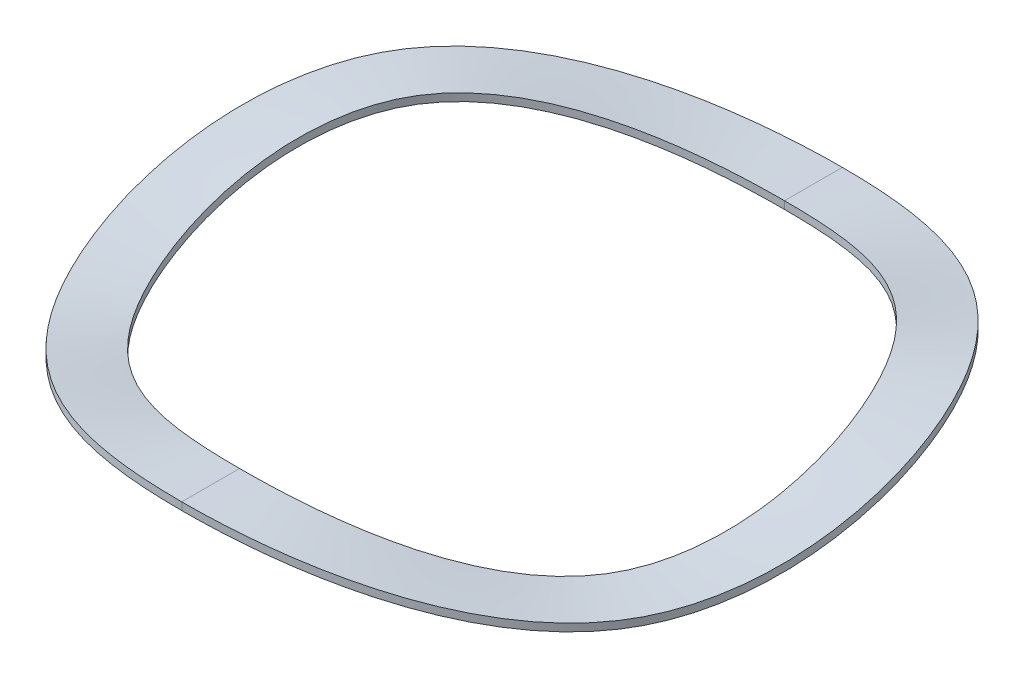
ISO-10303-21;
HEADER;
FILE_DESCRIPTION(('STEP AP214'),'2;1');
FILE_NAME('part.step','',(''),(''),'','','');
FILE_SCHEMA(('AUTOMOTIVE_DESIGN { 1 0 10303 214 1 1 1 1 }'));
ENDSEC;
DATA;
#1=APPLICATION_CONTEXT('core data for automotive mechanical design processes');
#2=APPLICATION_PROTOCOL_DEFINITION('international standard','automotive_design',2000,#1);
#3=PRODUCT_CONTEXT('',#1,'mechanical');
#4=PRODUCT('Part','Part','',(#3));
#5=PRODUCT_RELATED_PRODUCT_CATEGORY('part','',(#4));
#6=PRODUCT_DEFINITION_FORMATION('','',#4);
#7=PRODUCT_DEFINITION_CONTEXT('part definition',#1,'design');
#8=PRODUCT_DEFINITION('design','',#6,#7);
#9=PRODUCT_DEFINITION_SHAPE('','',#8);
#10=(LENGTH_UNIT() NAMED_UNIT(*) SI_UNIT(.MILLI.,.METRE.));
#11=(NAMED_UNIT(*) PLANE_ANGLE_UNIT() SI_UNIT($,.RADIAN.));
#12=(NAMED_UNIT(*) SI_UNIT($,.STERADIAN.) SOLID_ANGLE_UNIT());
#13=UNCERTAINTY_MEASURE_WITH_UNIT(LENGTH_MEASURE(1.E-05),#10,'distance_accuracy_value','');
#14=(GEOMETRIC_REPRESENTATION_CONTEXT(3) GLOBAL_UNCERTAINTY_ASSIGNED_CONTEXT((#13)) GLOBAL_UNIT_ASSIGNED_CONTEXT((#10,
#11,#12)) REPRESENTATION_CONTEXT('',''));
#15=CARTESIAN_POINT('',(0.,0.,0.));
#16=DIRECTION('',(0.,0.,1.));
#17=DIRECTION('',(1.,0.,0.));
#18=AXIS2_PLACEMENT_3D('',#15,#16,#17);
#19=CARTESIAN_POINT('',(0.,0.,-10.4775));
#20=CARTESIAN_POINT('',(3.62951246726,0.,-10.4775));
#21=CARTESIAN_POINT('',(10.8885374018,3.1242,-6.2865));
#22=CARTESIAN_POINT('',(10.8885374018,-1.5621,6.2865));
#23=CARTESIAN_POINT('',(3.62951246726,1.5621,10.4775));
#24=CARTESIAN_POINT('',(0.,1.5621,10.4775));
#25=CARTESIAN_POINT('',(0.,0.,-11.2183333333));
#26=CARTESIAN_POINT('',(3.88614466192,0.,-11.2183333333));
#27=CARTESIAN_POINT('',(11.6584339857,3.1242,-6.731));
#28=CARTESIAN_POINT('',(11.6584339857,-1.5621,6.731));
#29=CARTESIAN_POINT('',(3.88614466192,1.5621,11.2183333333));
#30=CARTESIAN_POINT('',(0.,1.5621,11.2183333333));
#31=CARTESIAN_POINT('',(0.,0.,-11.9591666667));
#32=CARTESIAN_POINT('',(4.14277685657,0.,-11.9591666667));
#33=CARTESIAN_POINT('',(12.4283305697,3.1242,-7.1755));
#34=CARTESIAN_POINT('',(12.4283305697,-1.5621,7.1755));
#35=CARTESIAN_POINT('',(4.14277685657,1.5621,11.9591666667));
#36=CARTESIAN_POINT('',(0.,1.5621,11.9591666667));
#37=CARTESIAN_POINT('',(0.,0.,-12.7));
#38=CARTESIAN_POINT('',(4.39940905122,0.,-12.7));
#39=CARTESIAN_POINT('',(13.1982271537,3.1242,-7.62));
#40=CARTESIAN_POINT('',(13.1982271537,-1.5621,7.62));
#41=CARTESIAN_POINT('',(4.39940905122,1.5621,12.7));
#42=CARTESIAN_POINT('',(0.,1.5621,12.7));
#43=B_SPLINE_SURFACE_WITH_KNOTS('',3,3,((#19,#20,#21,#22,#23,#24),(#25,#26,#27,#28,#29,#30),
(#31,#32,#33,#34,#35,#36),(#37,#38,#39,#40,#41,#42)),.UNSPECIFIED.,.F.,.F.,.F.,(4,4),(4,1,1,4),
(0.,2.45212916621),(0.,12.9217004676,25.8434009351,38.7651014027),.UNSPECIFIED.);
#44=DIRECTION('',(0.,0.,1.));
#45=VECTOR('',#44,1.);
#46=CARTESIAN_POINT('',(0.,0.,-11.58875));
#47=LINE('',#46,#45);
#48=CARTESIAN_POINT('',(0.,0.,-12.7));
#49=VERTEX_POINT('',#48);
#50=CARTESIAN_POINT('',(0.,0.,-10.4775));
#51=VERTEX_POINT('',#50);
#52=EDGE_CURVE('E58',#49,#51,#47,.T.);
#53=CARTESIAN_POINT('',(0.,0.,-12.7));
#54=CARTESIAN_POINT('',(4.39940905122,0.,-12.7));
#55=CARTESIAN_POINT('',(13.1982271537,3.1242,-7.62));
#56=CARTESIAN_POINT('',(13.1982271537,-1.5621,7.62));
#57=CARTESIAN_POINT('',(4.39940905122,1.5621,12.7));
#58=CARTESIAN_POINT('',(0.,1.5621,12.7));
#59=B_SPLINE_CURVE_WITH_KNOTS('',3,(#53,#54,#55,#56,#57,#58),.UNSPECIFIED.,.F.,.F.,(4,1,1,4),
(0.,14.1135670532,28.2271341065,42.3407011597),.UNSPECIFIED.);
#60=CARTESIAN_POINT('',(0.,1.5621,12.7));
#61=VERTEX_POINT('',#60);
#62=EDGE_CURVE('E61',#61,#49,#59,.F.);
#63=DIRECTION('',(0.,0.,1.));
#64=VECTOR('',#63,1.);
#65=CARTESIAN_POINT('',(0.,1.5621,11.58875));
#66=LINE('',#65,#64);
#67=CARTESIAN_POINT('',(0.,1.5621,10.4775));
#68=VERTEX_POINT('',#67);
#69=EDGE_CURVE('E23',#68,#61,#66,.T.);
#70=CARTESIAN_POINT('',(0.,0.,-10.4775));
#71=CARTESIAN_POINT('',(3.62951246726,0.,-10.4775));
#72=CARTESIAN_POINT('',(10.8885374018,3.1242,-6.2865));
#73=CARTESIAN_POINT('',(10.8885374018,-1.5621,6.2865));
#74=CARTESIAN_POINT('',(3.62951246726,1.5621,10.4775));
#75=CARTESIAN_POINT('',(0.,1.5621,10.4775));
#76=B_SPLINE_CURVE_WITH_KNOTS('',3,(#70,#71,#72,#73,#74,#75),.UNSPECIFIED.,.F.,.F.,(4,1,1,4),
(0.,11.7316793377,23.4633586753,35.195038013),.UNSPECIFIED.);
#77=EDGE_CURVE('E67',#51,#68,#76,.T.);
#78=ORIENTED_EDGE('',*,*,#52,.F.);
#79=ORIENTED_EDGE('',*,*,#62,.F.);
#80=ORIENTED_EDGE('',*,*,#69,.F.);
#81=ORIENTED_EDGE('',*,*,#77,.F.);
#82=EDGE_LOOP('',(#78,#79,#80,#81));
#83=FACE_BOUND('',#82,.T.);
#84=ADVANCED_FACE('F17',(#83),#43,.T.);
#85=CARTESIAN_POINT('',(0.,1.5621,10.4775));
#86=CARTESIAN_POINT('',(-3.62951246726,1.5621,10.4775));
#87=CARTESIAN_POINT('',(-10.8885374018,-1.5621,6.2865));
#88=CARTESIAN_POINT('',(-10.8885374018,3.1242,-6.2865));
#89=CARTESIAN_POINT('',(-3.62951246726,0.,-10.4775));
#90=CARTESIAN_POINT('',(0.,0.,-10.4775));
#91=CARTESIAN_POINT('',(0.,1.5621,11.2183333333));
#92=CARTESIAN_POINT('',(-3.88614466192,1.5621,11.2183333333));
#93=CARTESIAN_POINT('',(-11.6584339857,-1.5621,6.731));
#94=CARTESIAN_POINT('',(-11.6584339857,3.1242,-6.731));
#95=CARTESIAN_POINT('',(-3.88614466192,0.,-11.2183333333));
#96=CARTESIAN_POINT('',(0.,0.,-11.2183333333));
#97=CARTESIAN_POINT('',(0.,1.5621,11.9591666667));
#98=CARTESIAN_POINT('',(-4.14277685657,1.5621,11.9591666667));
#99=CARTESIAN_POINT('',(-12.4283305697,-1.5621,7.1755));
#100=CARTESIAN_POINT('',(-12.4283305697,3.1242,-7.1755));
#101=CARTESIAN_POINT('',(-4.14277685657,0.,-11.9591666667));
#102=CARTESIAN_POINT('',(0.,0.,-11.9591666667));
#103=CARTESIAN_POINT('',(0.,1.5621,12.7));
#104=CARTESIAN_POINT('',(-4.39940905122,1.5621,12.7));
#105=CARTESIAN_POINT('',(-13.1982271537,-1.5621,7.62));
#106=CARTESIAN_POINT('',(-13.1982271537,3.1242,-7.62));
#107=CARTESIAN_POINT('',(-4.39940905122,0.,-12.7));
#108=CARTESIAN_POINT('',(0.,0.,-12.7));
#109=B_SPLINE_SURFACE_WITH_KNOTS('',3,3,((#85,#86,#87,#88,#89,#90),(#91,#92,#93,#94,#95,#96),
(#97,#98,#99,#100,#101,#102),(#103,#104,#105,#106,#107,#108)),.UNSPECIFIED.,.F.,.F.,.F.,(4,4),
(4,1,1,4),(0.,2.45212916621),(38.7651014027,51.6868018703,64.6085023378,77.5302028054),.UNSPECIFIED.);
#110=CARTESIAN_POINT('',(0.,1.5621,12.7));
#111=CARTESIAN_POINT('',(-4.39940905122,1.5621,12.7));
#112=CARTESIAN_POINT('',(-13.1982271537,-1.5621,7.62));
#113=CARTESIAN_POINT('',(-13.1982271537,3.1242,-7.62));
#114=CARTESIAN_POINT('',(-4.39940905122,0.,-12.7));
#115=CARTESIAN_POINT('',(0.,0.,-12.7));
#116=B_SPLINE_CURVE_WITH_KNOTS('',3,(#110,#111,#112,#113,#114,#115),.UNSPECIFIED.,.F.,.F.,(4,1,
1,4),(42.3407011597,56.454268213,70.5678352662,84.6814023195),.UNSPECIFIED.);
#117=EDGE_CURVE('E73',#49,#61,#116,.F.);
#118=CARTESIAN_POINT('',(0.,1.5621,10.4775));
#119=CARTESIAN_POINT('',(-3.62951246726,1.5621,10.4775));
#120=CARTESIAN_POINT('',(-10.8885374018,-1.5621,6.2865));
#121=CARTESIAN_POINT('',(-10.8885374018,3.1242,-6.2865));
#122=CARTESIAN_POINT('',(-3.62951246726,0.,-10.4775));
#123=CARTESIAN_POINT('',(0.,0.,-10.4775));
#124=B_SPLINE_CURVE_WITH_KNOTS('',3,(#118,#119,#120,#121,#122,#123),.UNSPECIFIED.,.F.,.F.,(4,1,
1,4),(35.195038013,46.9267173507,58.6583966883,70.390076026),.UNSPECIFIED.);
#125=EDGE_CURVE('E75',#68,#51,#124,.T.);
#126=ORIENTED_EDGE('',*,*,#117,.F.);
#127=ORIENTED_EDGE('',*,*,#52,.T.);
#128=ORIENTED_EDGE('',*,*,#125,.F.);
#129=ORIENTED_EDGE('',*,*,#69,.T.);
#130=EDGE_LOOP('',(#126,#127,#128,#129));
#131=FACE_BOUND('',#130,.T.);
#132=ADVANCED_FACE('F71',(#131),#109,.T.);
#133=CARTESIAN_POINT('',(0.,0.,-12.7));
#134=CARTESIAN_POINT('',(4.39940905122,0.,-12.7));
#135=CARTESIAN_POINT('',(13.1982271537,3.1242,-7.62));
#136=CARTESIAN_POINT('',(13.1982271537,-1.5621,7.62));
#137=CARTESIAN_POINT('',(4.39940905122,1.5621,12.7));
#138=CARTESIAN_POINT('',(0.,1.5621,12.7));
#139=CARTESIAN_POINT('',(0.,0.0973666666667,-12.7));
#140=CARTESIAN_POINT('',(4.39940905122,0.0973666666667,-12.7));
#141=CARTESIAN_POINT('',(13.1982271537,3.22156666667,-7.62));
#142=CARTESIAN_POINT('',(13.1982271537,-1.46473333333,7.62));
#143=CARTESIAN_POINT('',(4.39940905122,1.65946666667,12.7));
#144=CARTESIAN_POINT('',(0.,1.65946666667,12.7));
#145=CARTESIAN_POINT('',(0.,0.194733333333,-12.7));
#146=CARTESIAN_POINT('',(4.39940905122,0.194733333333,-12.7));
#147=CARTESIAN_POINT('',(13.1982271537,3.31893333333,-7.62));
#148=CARTESIAN_POINT('',(13.1982271537,-1.36736666667,7.62));
#149=CARTESIAN_POINT('',(4.39940905122,1.75683333333,12.7));
#150=CARTESIAN_POINT('',(0.,1.75683333333,12.7));
#151=CARTESIAN_POINT('',(0.,0.2921,-12.7));
#152=CARTESIAN_POINT('',(4.39940905122,0.2921,-12.7));
#153=CARTESIAN_POINT('',(13.1982271537,3.4163,-7.62));
#154=CARTESIAN_POINT('',(13.1982271537,-1.27,7.62));
#155=CARTESIAN_POINT('',(4.39940905122,1.8542,12.7));
#156=CARTESIAN_POINT('',(0.,1.8542,12.7));
#157=B_SPLINE_SURFACE_WITH_KNOTS('',3,3,((#133,#134,#135,#136,#137,#138),(#139,#140,#141,#142,
#143,#144),(#145,#146,#147,#148,#149,#150),(#151,#152,#153,#154,#155,#156)),.UNSPECIFIED.,.F.,
.F.,.F.,(4,4),(4,1,1,4),(0.,0.2921),(0.,14.1135670532,28.2271341065,42.3407011597),.UNSPECIFIED.);
#158=DIRECTION('',(0.,-1.,0.));
#159=VECTOR('',#158,1.);
#160=CARTESIAN_POINT('',(0.,0.146049999999887,-12.7));
#161=LINE('',#160,#159);
#162=CARTESIAN_POINT('',(0.,0.2921,-12.7));
#163=VERTEX_POINT('',#162);
#164=EDGE_CURVE('E85',#163,#49,#161,.T.);
#165=CARTESIAN_POINT('',(0.,0.2921,-12.7));
#166=CARTESIAN_POINT('',(4.39940905122,0.2921,-12.7));
#167=CARTESIAN_POINT('',(13.1982271537,3.4163,-7.62));
#168=CARTESIAN_POINT('',(13.1982271537,-1.27,7.62));
#169=CARTESIAN_POINT('',(4.39940905122,1.8542,12.7));
#170=CARTESIAN_POINT('',(0.,1.8542,12.7));
#171=B_SPLINE_CURVE_WITH_KNOTS('',3,(#165,#166,#167,#168,#169,#170),.UNSPECIFIED.,.F.,.F.,(4,1,
1,4),(0.,12.9217004676,25.8434009351,38.7651014027),.UNSPECIFIED.);
#172=CARTESIAN_POINT('',(0.,1.8542,12.7));
#173=VERTEX_POINT('',#172);
#174=EDGE_CURVE('E81',#173,#163,#171,.F.);
#175=DIRECTION('',(0.,1.,0.));
#176=VECTOR('',#175,1.);
#177=CARTESIAN_POINT('',(0.,1.70815,12.7));
#178=LINE('',#177,#176);
#179=EDGE_CURVE('E78',#61,#173,#178,.T.);
#180=ORIENTED_EDGE('',*,*,#164,.F.);
#181=ORIENTED_EDGE('',*,*,#174,.F.);
#182=ORIENTED_EDGE('',*,*,#179,.F.);
#183=ORIENTED_EDGE('',*,*,#62,.T.);
#184=EDGE_LOOP('',(#180,#181,#182,#183));
#185=FACE_BOUND('',#184,.T.);
#186=ADVANCED_FACE('F79',(#185),#157,.T.);
#187=CARTESIAN_POINT('',(0.,0.2921,-10.4775));
#188=CARTESIAN_POINT('',(3.62951246726,0.2921,-10.4775));
#189=CARTESIAN_POINT('',(10.8885374018,3.4163,-6.2865));
#190=CARTESIAN_POINT('',(10.8885374018,-1.27,6.2865));
#191=CARTESIAN_POINT('',(3.62951246726,1.8542,10.4775));
#192=CARTESIAN_POINT('',(0.,1.8542,10.4775));
#193=CARTESIAN_POINT('',(0.,0.194733333333,-10.4775));
#194=CARTESIAN_POINT('',(3.62951246726,0.194733333333,-10.4775));
#195=CARTESIAN_POINT('',(10.8885374018,3.31893333333,-6.2865));
#196=CARTESIAN_POINT('',(10.8885374018,-1.36736666667,6.2865));
#197=CARTESIAN_POINT('',(3.62951246726,1.75683333333,10.4775));
#198=CARTESIAN_POINT('',(0.,1.75683333333,10.4775));
#199=CARTESIAN_POINT('',(0.,0.0973666666667,-10.4775));
#200=CARTESIAN_POINT('',(3.62951246726,0.0973666666667,-10.4775));
#201=CARTESIAN_POINT('',(10.8885374018,3.22156666667,-6.2865));
#202=CARTESIAN_POINT('',(10.8885374018,-1.46473333333,6.2865));
#203=CARTESIAN_POINT('',(3.62951246726,1.65946666667,10.4775));
#204=CARTESIAN_POINT('',(0.,1.65946666667,10.4775));
#205=CARTESIAN_POINT('',(0.,0.,-10.4775));
#206=CARTESIAN_POINT('',(3.62951246726,0.,-10.4775));
#207=CARTESIAN_POINT('',(10.8885374018,3.1242,-6.2865));
#208=CARTESIAN_POINT('',(10.8885374018,-1.5621,6.2865));
#209=CARTESIAN_POINT('',(3.62951246726,1.5621,10.4775));
#210=CARTESIAN_POINT('',(0.,1.5621,10.4775));
#211=B_SPLINE_SURFACE_WITH_KNOTS('',3,3,((#187,#188,#189,#190,#191,#192),(#193,#194,#195,#196,
#197,#198),(#199,#200,#201,#202,#203,#204),(#205,#206,#207,#208,#209,#210)),.UNSPECIFIED.,.F.,
.F.,.F.,(4,4),(4,1,1,4),(0.,0.2921),(0.,11.7316793377,23.4633586753,35.195038013),.UNSPECIFIED.);
#212=DIRECTION('',(0.,1.,0.));
#213=VECTOR('',#212,1.);
#214=CARTESIAN_POINT('',(0.,0.146049999999888,-10.4775));
#215=LINE('',#214,#213);
#216=CARTESIAN_POINT('',(0.,0.2921,-10.4775));
#217=VERTEX_POINT('',#216);
#218=EDGE_CURVE('E106',#51,#217,#215,.T.);
#219=DIRECTION('',(0.,-1.,0.));
#220=VECTOR('',#219,1.);
#221=CARTESIAN_POINT('',(0.,1.70815,10.4775));
#222=LINE('',#221,#220);
#223=CARTESIAN_POINT('',(0.,1.8542,10.4775));
#224=VERTEX_POINT('',#223);
#225=EDGE_CURVE('E113',#224,#68,#222,.T.);
#226=CARTESIAN_POINT('',(0.,0.2921,-10.4775));
#227=CARTESIAN_POINT('',(3.62951246726,0.2921,-10.4775));
#228=CARTESIAN_POINT('',(10.8885374018,3.4163,-6.2865));
#229=CARTESIAN_POINT('',(10.8885374018,-1.27,6.2865));
#230=CARTESIAN_POINT('',(3.62951246726,1.8542,10.4775));
#231=CARTESIAN_POINT('',(0.,1.8542,10.4775));
#232=B_SPLINE_CURVE_WITH_KNOTS('',3,(#226,#227,#228,#229,#230,#231),.UNSPECIFIED.,.F.,.F.,(4,1,
1,4),(0.,12.9217004676,25.8434009351,38.7651014027),.UNSPECIFIED.);
#233=EDGE_CURVE('E38',#217,#224,#232,.T.);
#234=ORIENTED_EDGE('',*,*,#218,.F.);
#235=ORIENTED_EDGE('',*,*,#77,.T.);
#236=ORIENTED_EDGE('',*,*,#225,.F.);
#237=ORIENTED_EDGE('',*,*,#233,.F.);
#238=EDGE_LOOP('',(#234,#235,#236,#237));
#239=FACE_BOUND('',#238,.T.);
#240=ADVANCED_FACE('F107',(#239),#211,.T.);
#241=CARTESIAN_POINT('',(0.,1.5621,12.7));
#242=CARTESIAN_POINT('',(-4.39940905122,1.5621,12.7));
#243=CARTESIAN_POINT('',(-13.1982271537,-1.5621,7.62));
#244=CARTESIAN_POINT('',(-13.1982271537,3.1242,-7.62));
#245=CARTESIAN_POINT('',(-4.39940905122,0.,-12.7));
#246=CARTESIAN_POINT('',(0.,0.,-12.7));
#247=CARTESIAN_POINT('',(0.,1.65946666667,12.7));
#248=CARTESIAN_POINT('',(-4.39940905122,1.65946666667,12.7));
#249=CARTESIAN_POINT('',(-13.1982271537,-1.46473333333,7.62));
#250=CARTESIAN_POINT('',(-13.1982271537,3.22156666667,-7.62));
#251=CARTESIAN_POINT('',(-4.39940905122,0.0973666666667,-12.7));
#252=CARTESIAN_POINT('',(0.,0.0973666666667,-12.7));
#253=CARTESIAN_POINT('',(0.,1.75683333333,12.7));
#254=CARTESIAN_POINT('',(-4.39940905122,1.75683333333,12.7));
#255=CARTESIAN_POINT('',(-13.1982271537,-1.36736666667,7.62));
#256=CARTESIAN_POINT('',(-13.1982271537,3.31893333333,-7.62));
#257=CARTESIAN_POINT('',(-4.39940905122,0.194733333333,-12.7));
#258=CARTESIAN_POINT('',(0.,0.194733333333,-12.7));
#259=CARTESIAN_POINT('',(0.,1.8542,12.7));
#260=CARTESIAN_POINT('',(-4.39940905122,1.8542,12.7));
#261=CARTESIAN_POINT('',(-13.1982271537,-1.27,7.62));
#262=CARTESIAN_POINT('',(-13.1982271537,3.4163,-7.62));
#263=CARTESIAN_POINT('',(-4.39940905122,0.2921,-12.7));
#264=CARTESIAN_POINT('',(0.,0.2921,-12.7));
#265=B_SPLINE_SURFACE_WITH_KNOTS('',3,3,((#241,#242,#243,#244,#245,#246),(#247,#248,#249,#250,
#251,#252),(#253,#254,#255,#256,#257,#258),(#259,#260,#261,#262,#263,#264)),.UNSPECIFIED.,.F.,
.F.,.F.,(4,4),(4,1,1,4),(0.,0.2921),(42.3407011597,56.454268213,70.5678352662,84.6814023195),.UNSPECIFIED.);
#266=CARTESIAN_POINT('',(0.,1.8542,12.7));
#267=CARTESIAN_POINT('',(-4.39940905122,1.8542,12.7));
#268=CARTESIAN_POINT('',(-13.1982271537,-1.27,7.62));
#269=CARTESIAN_POINT('',(-13.1982271537,3.4163,-7.62));
#270=CARTESIAN_POINT('',(-4.39940905122,0.2921,-12.7));
#271=CARTESIAN_POINT('',(0.,0.2921,-12.7));
#272=B_SPLINE_CURVE_WITH_KNOTS('',3,(#266,#267,#268,#269,#270,#271),.UNSPECIFIED.,.F.,.F.,(4,1,
1,4),(38.7651014027,51.6868018703,64.6085023378,77.5302028054),.UNSPECIFIED.);
#273=EDGE_CURVE('E131',#163,#173,#272,.F.);
#274=ORIENTED_EDGE('',*,*,#273,.F.);
#275=ORIENTED_EDGE('',*,*,#164,.T.);
#276=ORIENTED_EDGE('',*,*,#117,.T.);
#277=ORIENTED_EDGE('',*,*,#179,.T.);
#278=EDGE_LOOP('',(#274,#275,#276,#277));
#279=FACE_BOUND('',#278,.T.);
#280=ADVANCED_FACE('F87',(#279),#265,.T.);
#281=CARTESIAN_POINT('',(0.,1.8542,10.4775));
#282=CARTESIAN_POINT('',(-3.62951246726,1.8542,10.4775));
#283=CARTESIAN_POINT('',(-10.8885374018,-1.27,6.2865));
#284=CARTESIAN_POINT('',(-10.8885374018,3.4163,-6.2865));
#285=CARTESIAN_POINT('',(-3.62951246726,0.2921,-10.4775));
#286=CARTESIAN_POINT('',(0.,0.2921,-10.4775));
#287=CARTESIAN_POINT('',(0.,1.75683333333,10.4775));
#288=CARTESIAN_POINT('',(-3.62951246726,1.75683333333,10.4775));
#289=CARTESIAN_POINT('',(-10.8885374018,-1.36736666667,6.2865));
#290=CARTESIAN_POINT('',(-10.8885374018,3.31893333333,-6.2865));
#291=CARTESIAN_POINT('',(-3.62951246726,0.194733333333,-10.4775));
#292=CARTESIAN_POINT('',(0.,0.194733333333,-10.4775));
#293=CARTESIAN_POINT('',(0.,1.65946666667,10.4775));
#294=CARTESIAN_POINT('',(-3.62951246726,1.65946666667,10.4775));
#295=CARTESIAN_POINT('',(-10.8885374018,-1.46473333333,6.2865));
#296=CARTESIAN_POINT('',(-10.8885374018,3.22156666667,-6.2865));
#297=CARTESIAN_POINT('',(-3.62951246726,0.0973666666667,-10.4775));
#298=CARTESIAN_POINT('',(0.,0.0973666666667,-10.4775));
#299=CARTESIAN_POINT('',(0.,1.5621,10.4775));
#300=CARTESIAN_POINT('',(-3.62951246726,1.5621,10.4775));
#301=CARTESIAN_POINT('',(-10.8885374018,-1.5621,6.2865));
#302=CARTESIAN_POINT('',(-10.8885374018,3.1242,-6.2865));
#303=CARTESIAN_POINT('',(-3.62951246726,0.,-10.4775));
#304=CARTESIAN_POINT('',(0.,0.,-10.4775));
#305=B_SPLINE_SURFACE_WITH_KNOTS('',3,3,((#281,#282,#283,#284,#285,#286),(#287,#288,#289,#290,
#291,#292),(#293,#294,#295,#296,#297,#298),(#299,#300,#301,#302,#303,#304)),.UNSPECIFIED.,.F.,
.F.,.F.,(4,4),(4,1,1,4),(0.,0.2921),(35.195038013,46.9267173507,58.6583966883,70.390076026),.UNSPECIFIED.);
#306=CARTESIAN_POINT('',(0.,1.8542,10.4775));
#307=CARTESIAN_POINT('',(-3.62951246726,1.8542,10.4775));
#308=CARTESIAN_POINT('',(-10.8885374018,-1.27,6.2865));
#309=CARTESIAN_POINT('',(-10.8885374018,3.4163,-6.2865));
#310=CARTESIAN_POINT('',(-3.62951246726,0.2921,-10.4775));
#311=CARTESIAN_POINT('',(0.,0.2921,-10.4775));
#312=B_SPLINE_CURVE_WITH_KNOTS('',3,(#306,#307,#308,#309,#310,#311),.UNSPECIFIED.,.F.,.F.,(4,1,
1,4),(38.7651014027,51.6868018703,64.6085023378,77.5302028054),.UNSPECIFIED.);
#313=EDGE_CURVE('E29',#224,#217,#312,.T.);
#314=ORIENTED_EDGE('',*,*,#125,.T.);
#315=ORIENTED_EDGE('',*,*,#218,.T.);
#316=ORIENTED_EDGE('',*,*,#313,.F.);
#317=ORIENTED_EDGE('',*,*,#225,.T.);
#318=EDGE_LOOP('',(#314,#315,#316,#317));
#319=FACE_BOUND('',#318,.T.);
#320=ADVANCED_FACE('F112',(#319),#305,.T.);
#321=CARTESIAN_POINT('',(0.,0.2921,-12.7));
#322=CARTESIAN_POINT('',(4.39940905122,0.2921,-12.7));
#323=CARTESIAN_POINT('',(13.1982271537,3.4163,-7.62));
#324=CARTESIAN_POINT('',(13.1982271537,-1.27,7.62));
#325=CARTESIAN_POINT('',(4.39940905122,1.8542,12.7));
#326=CARTESIAN_POINT('',(0.,1.8542,12.7));
#327=CARTESIAN_POINT('',(0.,0.2921,-11.9591666667));
#328=CARTESIAN_POINT('',(4.14277685657,0.2921,-11.9591666667));
#329=CARTESIAN_POINT('',(12.4283305697,3.4163,-7.1755));
#330=CARTESIAN_POINT('',(12.4283305697,-1.27,7.1755));
#331=CARTESIAN_POINT('',(4.14277685657,1.8542,11.9591666667));
#332=CARTESIAN_POINT('',(0.,1.8542,11.9591666667));
#333=CARTESIAN_POINT('',(0.,0.2921,-11.2183333333));
#334=CARTESIAN_POINT('',(3.88614466192,0.2921,-11.2183333333));
#335=CARTESIAN_POINT('',(11.6584339857,3.4163,-6.731));
#336=CARTESIAN_POINT('',(11.6584339857,-1.27,6.731));
#337=CARTESIAN_POINT('',(3.88614466192,1.8542,11.2183333333));
#338=CARTESIAN_POINT('',(0.,1.8542,11.2183333333));
#339=CARTESIAN_POINT('',(0.,0.2921,-10.4775));
#340=CARTESIAN_POINT('',(3.62951246726,0.2921,-10.4775));
#341=CARTESIAN_POINT('',(10.8885374018,3.4163,-6.2865));
#342=CARTESIAN_POINT('',(10.8885374018,-1.27,6.2865));
#343=CARTESIAN_POINT('',(3.62951246726,1.8542,10.4775));
#344=CARTESIAN_POINT('',(0.,1.8542,10.4775));
#345=B_SPLINE_SURFACE_WITH_KNOTS('',3,3,((#321,#322,#323,#324,#325,#326),(#327,#328,#329,#330,
#331,#332),(#333,#334,#335,#336,#337,#338),(#339,#340,#341,#342,#343,#344)),.UNSPECIFIED.,.F.,
.F.,.F.,(4,4),(4,1,1,4),(0.,2.45212916621),(0.,12.9217004676,25.8434009351,38.7651014027),.UNSPECIFIED.);
#346=DIRECTION('',(0.,0.,-1.));
#347=VECTOR('',#346,1.);
#348=CARTESIAN_POINT('',(0.,0.2921,-11.58875));
#349=LINE('',#348,#347);
#350=EDGE_CURVE('E11',#217,#163,#349,.T.);
#351=DIRECTION('',(0.,0.,-1.));
#352=VECTOR('',#351,1.);
#353=CARTESIAN_POINT('',(0.,1.8542,11.58875));
#354=LINE('',#353,#352);
#355=EDGE_CURVE('E139',#173,#224,#354,.T.);
#356=ORIENTED_EDGE('',*,*,#350,.F.);
#357=ORIENTED_EDGE('',*,*,#233,.T.);
#358=ORIENTED_EDGE('',*,*,#355,.F.);
#359=ORIENTED_EDGE('',*,*,#174,.T.);
#360=EDGE_LOOP('',(#356,#357,#358,#359));
#361=FACE_BOUND('',#360,.T.);
#362=ADVANCED_FACE('F153',(#361),#345,.T.);
#363=CARTESIAN_POINT('',(0.,1.8542,12.7));
#364=CARTESIAN_POINT('',(-4.39940905122,1.8542,12.7));
#365=CARTESIAN_POINT('',(-13.1982271537,-1.27,7.62));
#366=CARTESIAN_POINT('',(-13.1982271537,3.4163,-7.62));
#367=CARTESIAN_POINT('',(-4.39940905122,0.2921,-12.7));
#368=CARTESIAN_POINT('',(0.,0.2921,-12.7));
#369=CARTESIAN_POINT('',(0.,1.8542,11.9591666667));
#370=CARTESIAN_POINT('',(-4.14277685657,1.8542,11.9591666667));
#371=CARTESIAN_POINT('',(-12.4283305697,-1.27,7.1755));
#372=CARTESIAN_POINT('',(-12.4283305697,3.4163,-7.1755));
#373=CARTESIAN_POINT('',(-4.14277685657,0.2921,-11.9591666667));
#374=CARTESIAN_POINT('',(0.,0.2921,-11.9591666667));
#375=CARTESIAN_POINT('',(0.,1.8542,11.2183333333));
#376=CARTESIAN_POINT('',(-3.88614466192,1.8542,11.2183333333));
#377=CARTESIAN_POINT('',(-11.6584339857,-1.27,6.731));
#378=CARTESIAN_POINT('',(-11.6584339857,3.4163,-6.731));
#379=CARTESIAN_POINT('',(-3.88614466192,0.2921,-11.2183333333));
#380=CARTESIAN_POINT('',(0.,0.2921,-11.2183333333));
#381=CARTESIAN_POINT('',(0.,1.8542,10.4775));
#382=CARTESIAN_POINT('',(-3.62951246726,1.8542,10.4775));
#383=CARTESIAN_POINT('',(-10.8885374018,-1.27,6.2865));
#384=CARTESIAN_POINT('',(-10.8885374018,3.4163,-6.2865));
#385=CARTESIAN_POINT('',(-3.62951246726,0.2921,-10.4775));
#386=CARTESIAN_POINT('',(0.,0.2921,-10.4775));
#387=B_SPLINE_SURFACE_WITH_KNOTS('',3,3,((#363,#364,#365,#366,#367,#368),(#369,#370,#371,#372,
#373,#374),(#375,#376,#377,#378,#379,#380),(#381,#382,#383,#384,#385,#386)),.UNSPECIFIED.,.F.,
.F.,.F.,(4,4),(4,1,1,4),(0.,2.45212916621),(38.7651014027,51.6868018703,64.6085023378,
77.5302028054),.UNSPECIFIED.);
#388=ORIENTED_EDGE('',*,*,#313,.T.);
#389=ORIENTED_EDGE('',*,*,#350,.T.);
#390=ORIENTED_EDGE('',*,*,#273,.T.);
#391=ORIENTED_EDGE('',*,*,#355,.T.);
#392=EDGE_LOOP('',(#388,#389,#390,#391));
#393=FACE_BOUND('',#392,.T.);
#394=ADVANCED_FACE('F19',(#393),#387,.T.);
#395=CLOSED_SHELL('',(#84,#132,#186,#240,#280,#320,#362,#394));
#396=MANIFOLD_SOLID_BREP('B1',#395);
#397=ADVANCED_BREP_SHAPE_REPRESENTATION('',(#18,#396),#14);
#398=SHAPE_DEFINITION_REPRESENTATION(#9,#397);
ENDSEC;
END-ISO-10303-21;
